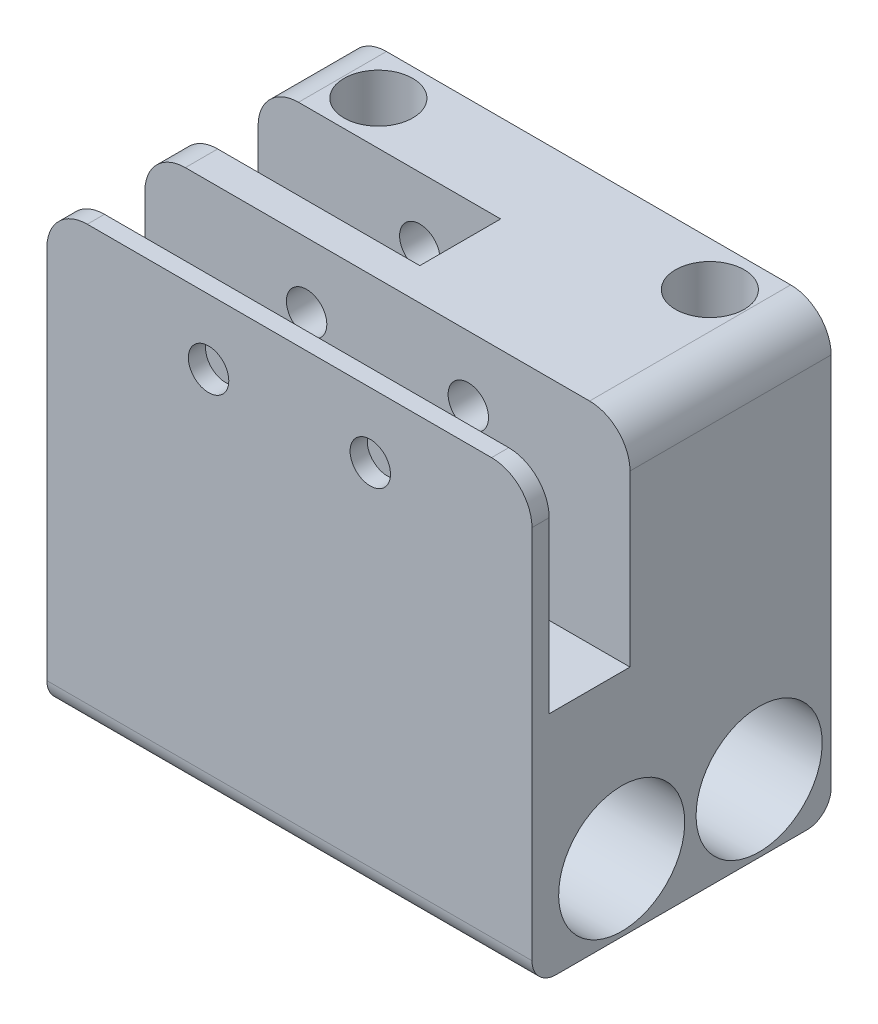
ISO-10303-21;
HEADER;
FILE_DESCRIPTION(('STEP AP214'),'2;1');
FILE_NAME('part.step','',(''),(''),'','','');
FILE_SCHEMA(('AUTOMOTIVE_DESIGN { 1 0 10303 214 1 1 1 1 }'));
ENDSEC;
DATA;
#1=APPLICATION_CONTEXT('core data for automotive mechanical design processes');
#2=APPLICATION_PROTOCOL_DEFINITION('international standard','automotive_design',2000,#1);
#3=PRODUCT_CONTEXT('',#1,'mechanical');
#4=PRODUCT('Part','Part','',(#3));
#5=PRODUCT_RELATED_PRODUCT_CATEGORY('part','',(#4));
#6=PRODUCT_DEFINITION_FORMATION('','',#4);
#7=PRODUCT_DEFINITION_CONTEXT('part definition',#1,'design');
#8=PRODUCT_DEFINITION('design','',#6,#7);
#9=PRODUCT_DEFINITION_SHAPE('','',#8);
#10=(LENGTH_UNIT() NAMED_UNIT(*) SI_UNIT(.MILLI.,.METRE.));
#11=(NAMED_UNIT(*) PLANE_ANGLE_UNIT() SI_UNIT($,.RADIAN.));
#12=(NAMED_UNIT(*) SI_UNIT($,.STERADIAN.) SOLID_ANGLE_UNIT());
#13=UNCERTAINTY_MEASURE_WITH_UNIT(LENGTH_MEASURE(1.E-05),#10,'distance_accuracy_value','');
#14=(GEOMETRIC_REPRESENTATION_CONTEXT(3) GLOBAL_UNCERTAINTY_ASSIGNED_CONTEXT((#13)) GLOBAL_UNIT_ASSIGNED_CONTEXT((#10,
#11,#12)) REPRESENTATION_CONTEXT('',''));
#15=CARTESIAN_POINT('',(0.,0.,0.));
#16=DIRECTION('',(0.,0.,1.));
#17=DIRECTION('',(1.,0.,0.));
#18=AXIS2_PLACEMENT_3D('',#15,#16,#17);
#19=CARTESIAN_POINT('',(-245.000000000002,163.212189340529,40.0000000000007));
#20=DIRECTION('',(0.,0.,-1.));
#21=DIRECTION('',(-1.,0.,0.));
#22=AXIS2_PLACEMENT_3D('',#19,#20,#21);
#23=CYLINDRICAL_SURFACE('',#22,5.);
#24=DIRECTION('',(0.,0.,-1.));
#25=VECTOR('',#24,1.);
#26=CARTESIAN_POINT('',(-250.000000000002,163.212189340529,40.0000000000007));
#27=LINE('',#26,#25);
#28=CARTESIAN_POINT('',(-250.000000000002,163.212189340529,13.8748607563633));
#29=VERTEX_POINT('',#28);
#30=CARTESIAN_POINT('',(-250.000000000002,163.212189340529,3.));
#31=VERTEX_POINT('',#30);
#32=EDGE_CURVE('E289',#29,#31,#27,.T.);
#33=ORIENTED_EDGE('',*,*,#32,.F.);
#34=CARTESIAN_POINT('',(-245.000000000002,163.212189340529,13.8748607563633));
#35=DIRECTION('',(0.,0.,-1.));
#36=DIRECTION('',(0.,1.,0.));
#37=AXIS2_PLACEMENT_3D('',#34,#35,#36);
#38=CIRCLE('',#37,5.);
#39=CARTESIAN_POINT('',(-245.000000000002,168.212189340529,13.8748607563633));
#40=VERTEX_POINT('',#39);
#41=EDGE_CURVE('E199',#29,#40,#38,.T.);
#42=ORIENTED_EDGE('',*,*,#41,.T.);
#43=DIRECTION('',(0.,0.,-1.));
#44=VECTOR('',#43,1.);
#45=CARTESIAN_POINT('',(-245.000000000002,168.212189340529,40.0000000000007));
#46=LINE('',#45,#44);
#47=CARTESIAN_POINT('',(-245.000000000002,168.212189340529,3.));
#48=VERTEX_POINT('',#47);
#49=EDGE_CURVE('E293',#40,#48,#46,.T.);
#50=ORIENTED_EDGE('',*,*,#49,.T.);
#51=CARTESIAN_POINT('',(-245.000000000002,163.212189340529,3.));
#52=DIRECTION('',(0.,0.,-1.));
#53=DIRECTION('',(-1.,0.,0.));
#54=AXIS2_PLACEMENT_3D('',#51,#52,#53);
#55=CIRCLE('',#54,5.);
#56=EDGE_CURVE('E249',#31,#48,#55,.T.);
#57=ORIENTED_EDGE('',*,*,#56,.F.);
#58=EDGE_LOOP('',(#33,#42,#50,#57));
#59=FACE_BOUND('',#58,.T.);
#60=ADVANCED_FACE('F33',(#59),#23,.T.);
#61=CARTESIAN_POINT('',(-195.000000000002,163.212189340529,40.0000000000007));
#62=DIRECTION('',(0.,0.,-1.));
#63=DIRECTION('',(-1.,0.,0.));
#64=AXIS2_PLACEMENT_3D('',#61,#62,#63);
#65=CYLINDRICAL_SURFACE('',#64,5.);
#66=DIRECTION('',(0.,0.,-1.));
#67=VECTOR('',#66,1.);
#68=CARTESIAN_POINT('',(-195.000000000002,168.212189340529,40.0000000000007));
#69=LINE('',#68,#67);
#70=CARTESIAN_POINT('',(-195.000000000002,168.212189340529,27.8748607563632));
#71=VERTEX_POINT('',#70);
#72=CARTESIAN_POINT('',(-195.000000000002,168.212189340529,3.));
#73=VERTEX_POINT('',#72);
#74=EDGE_CURVE('E298',#71,#73,#69,.T.);
#75=ORIENTED_EDGE('',*,*,#74,.F.);
#76=CARTESIAN_POINT('',(-195.000000000002,163.212189340529,27.8748607563633));
#77=DIRECTION('',(0.,0.,-1.));
#78=DIRECTION('',(0.,1.,0.));
#79=AXIS2_PLACEMENT_3D('',#76,#77,#78);
#80=CIRCLE('',#79,5.);
#81=CARTESIAN_POINT('',(-190.000000000002,163.212189340529,27.8748607563633));
#82=VERTEX_POINT('',#81);
#83=EDGE_CURVE('E237',#71,#82,#80,.T.);
#84=ORIENTED_EDGE('',*,*,#83,.T.);
#85=DIRECTION('',(0.,0.,-1.));
#86=VECTOR('',#85,1.);
#87=CARTESIAN_POINT('',(-190.000000000002,163.212189340529,40.0000000000007));
#88=LINE('',#87,#86);
#89=CARTESIAN_POINT('',(-190.000000000002,163.212189340529,3.));
#90=VERTEX_POINT('',#89);
#91=EDGE_CURVE('E279',#82,#90,#88,.T.);
#92=ORIENTED_EDGE('',*,*,#91,.T.);
#93=CARTESIAN_POINT('',(-195.000000000002,163.212189340529,3.));
#94=DIRECTION('',(0.,0.,-1.));
#95=DIRECTION('',(-1.,0.,0.));
#96=AXIS2_PLACEMENT_3D('',#93,#94,#95);
#97=CIRCLE('',#96,5.);
#98=EDGE_CURVE('E240',#73,#90,#97,.T.);
#99=ORIENTED_EDGE('',*,*,#98,.F.);
#100=EDGE_LOOP('',(#75,#84,#92,#99));
#101=FACE_BOUND('',#100,.T.);
#102=ADVANCED_FACE('F381',(#101),#65,.T.);
#103=CARTESIAN_POINT('',(-245.000000000002,168.212189340529,40.0000000000007));
#104=DIRECTION('',(0.,-1.,0.));
#105=DIRECTION('',(0.,0.,-1.));
#106=AXIS2_PLACEMENT_3D('',#103,#104,#105);
#107=PLANE('',#106);
#108=CARTESIAN_POINT('',(-199.500000000002,168.212189340529,8.5));
#109=DIRECTION('',(0.,1.,0.));
#110=DIRECTION('',(0.,0.,1.));
#111=AXIS2_PLACEMENT_3D('',#108,#109,#110);
#112=CIRCLE('',#111,4.25000000000001);
#113=CARTESIAN_POINT('',(-199.500000000002,168.212189340529,12.75));
#114=VERTEX_POINT('',#113);
#115=EDGE_CURVE('E641',#114,#114,#112,.T.);
#116=ORIENTED_EDGE('',*,*,#115,.F.);
#117=EDGE_LOOP('',(#116));
#118=FACE_BOUND('',#117,.T.);
#119=CARTESIAN_POINT('',(-240.500000000002,168.212189340529,8.50000000000003));
#120=DIRECTION('',(0.,1.,0.));
#121=DIRECTION('',(0.,0.,-1.));
#122=AXIS2_PLACEMENT_3D('',#119,#120,#121);
#123=CIRCLE('',#122,4.25);
#124=CARTESIAN_POINT('',(-240.500000000002,168.212189340529,4.25000000000003));
#125=VERTEX_POINT('',#124);
#126=EDGE_CURVE('E342',#125,#125,#123,.T.);
#127=ORIENTED_EDGE('',*,*,#126,.F.);
#128=EDGE_LOOP('',(#127));
#129=FACE_BOUND('',#128,.T.);
#130=ORIENTED_EDGE('',*,*,#49,.F.);
#131=DIRECTION('',(1.,0.,0.));
#132=VECTOR('',#131,1.);
#133=CARTESIAN_POINT('',(-245.000000000002,168.212189340529,13.8748607563633));
#134=LINE('',#133,#132);
#135=CARTESIAN_POINT('',(-220.000000000002,168.212189340529,13.8748607563643));
#136=VERTEX_POINT('',#135);
#137=EDGE_CURVE('E202',#40,#136,#134,.T.);
#138=ORIENTED_EDGE('',*,*,#137,.T.);
#139=DIRECTION('',(0.,0.,-1.));
#140=VECTOR('',#139,1.);
#141=CARTESIAN_POINT('',(-220.000000000002,168.212189340529,40.0000000000007));
#142=LINE('',#141,#140);
#143=CARTESIAN_POINT('',(-220.000000000002,168.212189340529,23.8748607563633));
#144=VERTEX_POINT('',#143);
#145=EDGE_CURVE('E11',#144,#136,#142,.T.);
#146=ORIENTED_EDGE('',*,*,#145,.F.);
#147=DIRECTION('',(-1.,0.,0.));
#148=VECTOR('',#147,1.);
#149=CARTESIAN_POINT('',(-245.000000000002,168.212189340529,23.8748607563643));
#150=LINE('',#149,#148);
#151=CARTESIAN_POINT('',(-245.000000000002,168.212189340529,23.8748607563643));
#152=VERTEX_POINT('',#151);
#153=EDGE_CURVE('E178',#144,#152,#150,.T.);
#154=ORIENTED_EDGE('',*,*,#153,.T.);
#155=CARTESIAN_POINT('',(-245.000000000002,168.212189340529,27.8748607563632));
#156=VERTEX_POINT('',#155);
#157=EDGE_CURVE('E299',#156,#152,#46,.T.);
#158=ORIENTED_EDGE('',*,*,#157,.F.);
#159=DIRECTION('',(1.,0.,0.));
#160=VECTOR('',#159,1.);
#161=CARTESIAN_POINT('',(-245.000000000002,168.212189340529,27.8748607563632));
#162=LINE('',#161,#160);
#163=EDGE_CURVE('E234',#156,#71,#162,.T.);
#164=ORIENTED_EDGE('',*,*,#163,.T.);
#165=ORIENTED_EDGE('',*,*,#74,.T.);
#166=DIRECTION('',(1.,0.,0.));
#167=VECTOR('',#166,1.);
#168=CARTESIAN_POINT('',(-245.000000000002,168.212189340529,3.));
#169=LINE('',#168,#167);
#170=EDGE_CURVE('E252',#48,#73,#169,.T.);
#171=ORIENTED_EDGE('',*,*,#170,.F.);
#172=EDGE_LOOP('',(#130,#138,#146,#154,#158,#164,#165,#171));
#173=FACE_BOUND('',#172,.T.);
#174=ADVANCED_FACE('F389',(#118,#129,#173),#107,.F.);
#175=ORIENTED_EDGE('',*,*,#157,.T.);
#176=CARTESIAN_POINT('',(-245.000000000002,163.212189340529,23.874860756364));
#177=DIRECTION('',(0.,0.,1.));
#178=DIRECTION('',(0.,-1.,0.));
#179=AXIS2_PLACEMENT_3D('',#176,#177,#178);
#180=CIRCLE('',#179,5.);
#181=CARTESIAN_POINT('',(-250.000000000002,163.212189340529,23.874860756364));
#182=VERTEX_POINT('',#181);
#183=EDGE_CURVE('E194',#152,#182,#180,.T.);
#184=ORIENTED_EDGE('',*,*,#183,.T.);
#185=CARTESIAN_POINT('',(-250.000000000002,163.212189340529,27.8748607563633));
#186=VERTEX_POINT('',#185);
#187=EDGE_CURVE('E294',#186,#182,#27,.T.);
#188=ORIENTED_EDGE('',*,*,#187,.F.);
#189=CARTESIAN_POINT('',(-245.000000000002,163.212189340529,27.8748607563633));
#190=DIRECTION('',(0.,0.,-1.));
#191=DIRECTION('',(0.,1.,0.));
#192=AXIS2_PLACEMENT_3D('',#189,#190,#191);
#193=CIRCLE('',#192,5.);
#194=EDGE_CURVE('E231',#186,#156,#193,.T.);
#195=ORIENTED_EDGE('',*,*,#194,.T.);
#196=EDGE_LOOP('',(#175,#184,#188,#195));
#197=FACE_BOUND('',#196,.T.);
#198=ADVANCED_FACE('F384',(#197),#23,.T.);
#199=CARTESIAN_POINT('',(-190.000000000002,163.212189340529,40.0000000000007));
#200=VERTEX_POINT('',#199);
#201=CARTESIAN_POINT('',(-190.000000000002,163.212189340529,37.8748607563633));
#202=VERTEX_POINT('',#201);
#203=EDGE_CURVE('E280',#200,#202,#88,.T.);
#204=ORIENTED_EDGE('',*,*,#203,.T.);
#205=CARTESIAN_POINT('',(-195.000000000002,163.212189340529,37.8748607563633));
#206=DIRECTION('',(0.,0.,1.));
#207=DIRECTION('',(0.,-1.,0.));
#208=AXIS2_PLACEMENT_3D('',#205,#206,#207);
#209=CIRCLE('',#208,5.);
#210=CARTESIAN_POINT('',(-195.000000000002,168.212189340529,37.8748607563633));
#211=VERTEX_POINT('',#210);
#212=EDGE_CURVE('E58',#202,#211,#209,.T.);
#213=ORIENTED_EDGE('',*,*,#212,.T.);
#214=CARTESIAN_POINT('',(-195.000000000002,168.212189340529,40.0000000000007));
#215=VERTEX_POINT('',#214);
#216=EDGE_CURVE('E300',#215,#211,#69,.T.);
#217=ORIENTED_EDGE('',*,*,#216,.F.);
#218=CARTESIAN_POINT('',(-195.000000000002,163.212189340529,40.0000000000007));
#219=DIRECTION('',(0.,0.,1.));
#220=DIRECTION('',(-1.,0.,0.));
#221=AXIS2_PLACEMENT_3D('',#218,#219,#220);
#222=CIRCLE('',#221,5.);
#223=EDGE_CURVE('E259',#200,#215,#222,.T.);
#224=ORIENTED_EDGE('',*,*,#223,.F.);
#225=EDGE_LOOP('',(#204,#213,#217,#224));
#226=FACE_BOUND('',#225,.T.);
#227=ADVANCED_FACE('F392',(#226),#65,.T.);
#228=ORIENTED_EDGE('',*,*,#216,.T.);
#229=DIRECTION('',(-1.,0.,0.));
#230=VECTOR('',#229,1.);
#231=CARTESIAN_POINT('',(-245.000000000002,168.212189340529,37.8748607563633));
#232=LINE('',#231,#230);
#233=CARTESIAN_POINT('',(-245.000000000002,168.212189340529,37.8748607563633));
#234=VERTEX_POINT('',#233);
#235=EDGE_CURVE('E227',#211,#234,#232,.T.);
#236=ORIENTED_EDGE('',*,*,#235,.T.);
#237=CARTESIAN_POINT('',(-245.000000000002,168.212189340529,40.0000000000007));
#238=VERTEX_POINT('',#237);
#239=EDGE_CURVE('E295',#238,#234,#46,.T.);
#240=ORIENTED_EDGE('',*,*,#239,.F.);
#241=DIRECTION('',(-1.,0.,0.));
#242=VECTOR('',#241,1.);
#243=CARTESIAN_POINT('',(-245.000000000002,168.212189340529,40.0000000000007));
#244=LINE('',#243,#242);
#245=EDGE_CURVE('E270',#215,#238,#244,.T.);
#246=ORIENTED_EDGE('',*,*,#245,.F.);
#247=EDGE_LOOP('',(#228,#236,#240,#246));
#248=FACE_BOUND('',#247,.T.);
#249=ADVANCED_FACE('F400',(#248),#107,.F.);
#250=ORIENTED_EDGE('',*,*,#239,.T.);
#251=CARTESIAN_POINT('',(-245.000000000002,163.212189340529,37.8748607563633));
#252=DIRECTION('',(0.,0.,1.));
#253=DIRECTION('',(0.,-1.,0.));
#254=AXIS2_PLACEMENT_3D('',#251,#252,#253);
#255=CIRCLE('',#254,5.);
#256=CARTESIAN_POINT('',(-250.000000000002,163.212189340529,37.8748607563633));
#257=VERTEX_POINT('',#256);
#258=EDGE_CURVE('E222',#234,#257,#255,.T.);
#259=ORIENTED_EDGE('',*,*,#258,.T.);
#260=CARTESIAN_POINT('',(-250.000000000002,163.212189340529,40.0000000000007));
#261=VERTEX_POINT('',#260);
#262=EDGE_CURVE('E290',#261,#257,#27,.T.);
#263=ORIENTED_EDGE('',*,*,#262,.F.);
#264=CARTESIAN_POINT('',(-245.000000000002,163.212189340529,40.0000000000007));
#265=DIRECTION('',(0.,0.,1.));
#266=DIRECTION('',(-1.,0.,0.));
#267=AXIS2_PLACEMENT_3D('',#264,#265,#266);
#268=CIRCLE('',#267,5.);
#269=EDGE_CURVE('E272',#238,#261,#268,.T.);
#270=ORIENTED_EDGE('',*,*,#269,.F.);
#271=EDGE_LOOP('',(#250,#259,#263,#270));
#272=FACE_BOUND('',#271,.T.);
#273=ADVANCED_FACE('F385',(#272),#23,.T.);
#274=CARTESIAN_POINT('',(-250.000000000002,138.123568891244,40.0000000000007));
#275=DIRECTION('',(1.,0.,0.));
#276=DIRECTION('',(0.,0.,-1.));
#277=AXIS2_PLACEMENT_3D('',#274,#275,#276);
#278=PLANE('',#277);
#279=CARTESIAN_POINT('',(-250.000000000002,122.212171492543,28.9024120802243));
#280=DIRECTION('',(1.,0.,0.));
#281=DIRECTION('',(0.,1.,0.));
#282=AXIS2_PLACEMENT_3D('',#279,#280,#281);
#283=CIRCLE('',#282,7.80000000000167);
#284=CARTESIAN_POINT('',(-250.000000000002,130.012171492544,28.9024120802243));
#285=VERTEX_POINT('',#284);
#286=EDGE_CURVE('E263',#285,#285,#283,.T.);
#287=ORIENTED_EDGE('',*,*,#286,.T.);
#288=EDGE_LOOP('',(#287));
#289=FACE_BOUND('',#288,.T.);
#290=CARTESIAN_POINT('',(-250.000000000002,122.212171492543,11.9024120802243));
#291=DIRECTION('',(1.,0.,0.));
#292=DIRECTION('',(0.,1.,0.));
#293=AXIS2_PLACEMENT_3D('',#290,#291,#292);
#294=CIRCLE('',#293,7.8000000000017);
#295=CARTESIAN_POINT('',(-250.000000000002,130.012171492544,11.9024120802243));
#296=VERTEX_POINT('',#295);
#297=EDGE_CURVE('E256',#296,#296,#294,.T.);
#298=ORIENTED_EDGE('',*,*,#297,.T.);
#299=EDGE_LOOP('',(#298));
#300=FACE_BOUND('',#299,.T.);
#301=DIRECTION('',(0.,0.,1.));
#302=VECTOR('',#301,1.);
#303=CARTESIAN_POINT('',(-250.000000000002,142.212171492543,13.8748607563632));
#304=LINE('',#303,#302);
#305=CARTESIAN_POINT('',(-250.000000000002,142.212171492543,13.8748607563632));
#306=VERTEX_POINT('',#305);
#307=CARTESIAN_POINT('',(-250.000000000002,142.212171492543,23.8748607563626));
#308=VERTEX_POINT('',#307);
#309=EDGE_CURVE('E50',#306,#308,#304,.T.);
#310=ORIENTED_EDGE('',*,*,#309,.F.);
#311=DIRECTION('',(0.,1.,0.));
#312=VECTOR('',#311,1.);
#313=CARTESIAN_POINT('',(-250.000000000002,138.123568891244,13.8748607563632));
#314=LINE('',#313,#312);
#315=EDGE_CURVE('E42',#306,#29,#314,.T.);
#316=ORIENTED_EDGE('',*,*,#315,.T.);
#317=ORIENTED_EDGE('',*,*,#32,.T.);
#318=DIRECTION('',(0.,1.,0.));
#319=VECTOR('',#318,1.);
#320=CARTESIAN_POINT('',(-250.000000000002,113.822486612554,3.));
#321=LINE('',#320,#319);
#322=CARTESIAN_POINT('',(-250.000000000002,116.822486612554,3.));
#323=VERTEX_POINT('',#322);
#324=EDGE_CURVE('E246',#323,#31,#321,.T.);
#325=ORIENTED_EDGE('',*,*,#324,.F.);
#326=CARTESIAN_POINT('',(-250.000000000002,116.822486612554,6.));
#327=DIRECTION('',(1.,0.,0.));
#328=DIRECTION('',(0.,0.,-1.));
#329=AXIS2_PLACEMENT_3D('',#326,#327,#328);
#330=CIRCLE('',#329,3.);
#331=CARTESIAN_POINT('',(-250.000000000002,113.822486612554,6.));
#332=VERTEX_POINT('',#331);
#333=EDGE_CURVE('E308',#323,#332,#330,.F.);
#334=ORIENTED_EDGE('',*,*,#333,.T.);
#335=DIRECTION('',(0.,0.,-1.));
#336=VECTOR('',#335,1.);
#337=CARTESIAN_POINT('',(-250.000000000002,113.822486612554,40.0000000000007));
#338=LINE('',#337,#336);
#339=CARTESIAN_POINT('',(-250.000000000002,113.822486612554,37.0000000000007));
#340=VERTEX_POINT('',#339);
#341=EDGE_CURVE('E286',#340,#332,#338,.T.);
#342=ORIENTED_EDGE('',*,*,#341,.F.);
#343=CARTESIAN_POINT('',(-250.000000000002,116.822486612554,37.0000000000007));
#344=DIRECTION('',(1.,0.,0.));
#345=DIRECTION('',(0.,0.,-1.));
#346=AXIS2_PLACEMENT_3D('',#343,#344,#345);
#347=CIRCLE('',#346,3.);
#348=CARTESIAN_POINT('',(-250.000000000002,116.822486612554,40.0000000000007));
#349=VERTEX_POINT('',#348);
#350=EDGE_CURVE('E306',#340,#349,#347,.F.);
#351=ORIENTED_EDGE('',*,*,#350,.T.);
#352=DIRECTION('',(0.,-1.,0.));
#353=VECTOR('',#352,1.);
#354=CARTESIAN_POINT('',(-250.000000000002,138.123568891244,40.0000000000007));
#355=LINE('',#354,#353);
#356=EDGE_CURVE('E274',#261,#349,#355,.T.);
#357=ORIENTED_EDGE('',*,*,#356,.F.);
#358=ORIENTED_EDGE('',*,*,#262,.T.);
#359=DIRECTION('',(0.,-1.,0.));
#360=VECTOR('',#359,1.);
#361=CARTESIAN_POINT('',(-250.000000000002,152.212171492543,37.8748607563633));
#362=LINE('',#361,#360);
#363=CARTESIAN_POINT('',(-250.000000000002,142.212171492543,37.8748607563632));
#364=VERTEX_POINT('',#363);
#365=EDGE_CURVE('E206',#257,#364,#362,.T.);
#366=ORIENTED_EDGE('',*,*,#365,.T.);
#367=DIRECTION('',(0.,0.,-1.));
#368=VECTOR('',#367,1.);
#369=CARTESIAN_POINT('',(-250.000000000002,142.212171492543,27.8748607563632));
#370=LINE('',#369,#368);
#371=CARTESIAN_POINT('',(-250.000000000002,142.212171492543,27.8748607563632));
#372=VERTEX_POINT('',#371);
#373=EDGE_CURVE('E209',#364,#372,#370,.T.);
#374=ORIENTED_EDGE('',*,*,#373,.T.);
#375=DIRECTION('',(0.,1.,0.));
#376=VECTOR('',#375,1.);
#377=CARTESIAN_POINT('',(-250.000000000002,142.212171492543,27.8748607563632));
#378=LINE('',#377,#376);
#379=EDGE_CURVE('E213',#372,#186,#378,.T.);
#380=ORIENTED_EDGE('',*,*,#379,.T.);
#381=ORIENTED_EDGE('',*,*,#187,.T.);
#382=DIRECTION('',(0.,1.,0.));
#383=VECTOR('',#382,1.);
#384=CARTESIAN_POINT('',(-250.000000000002,152.212171492543,23.8748607563633));
#385=LINE('',#384,#383);
#386=EDGE_CURVE('E185',#308,#182,#385,.T.);
#387=ORIENTED_EDGE('',*,*,#386,.F.);
#388=EDGE_LOOP('',(#310,#316,#317,#325,#334,#342,#351,#357,#358,#366,#374,#380,#381,#387));
#389=FACE_BOUND('',#388,.T.);
#390=ADVANCED_FACE('F399',(#289,#300,#389),#278,.F.);
#391=CARTESIAN_POINT('',(-194.03319899616,113.822486612554,40.0000000000007));
#392=DIRECTION('',(0.,1.,0.));
#393=DIRECTION('',(0.,0.,1.));
#394=AXIS2_PLACEMENT_3D('',#391,#392,#393);
#395=PLANE('',#394);
#396=ORIENTED_EDGE('',*,*,#341,.T.);
#397=DIRECTION('',(-1.,0.,0.));
#398=VECTOR('',#397,1.);
#399=CARTESIAN_POINT('',(-190.000000000002,113.822486612554,6.));
#400=LINE('',#399,#398);
#401=CARTESIAN_POINT('',(-190.000000000002,113.822486612554,6.));
#402=VERTEX_POINT('',#401);
#403=EDGE_CURVE('E312',#332,#402,#400,.F.);
#404=ORIENTED_EDGE('',*,*,#403,.T.);
#405=DIRECTION('',(0.,0.,-1.));
#406=VECTOR('',#405,1.);
#407=CARTESIAN_POINT('',(-190.000000000002,113.822486612554,40.0000000000007));
#408=LINE('',#407,#406);
#409=CARTESIAN_POINT('',(-190.000000000002,113.822486612554,37.0000000000007));
#410=VERTEX_POINT('',#409);
#411=EDGE_CURVE('E283',#410,#402,#408,.T.);
#412=ORIENTED_EDGE('',*,*,#411,.F.);
#413=DIRECTION('',(1.,0.,0.));
#414=VECTOR('',#413,1.);
#415=CARTESIAN_POINT('',(-194.03319899616,113.822486612554,37.0000000000007));
#416=LINE('',#415,#414);
#417=EDGE_CURVE('E310',#410,#340,#416,.F.);
#418=ORIENTED_EDGE('',*,*,#417,.T.);
#419=EDGE_LOOP('',(#396,#404,#412,#418));
#420=FACE_BOUND('',#419,.T.);
#421=ADVANCED_FACE('F406',(#420),#395,.F.);
#422=CARTESIAN_POINT('',(-190.000000000002,163.212189340529,40.0000000000007));
#423=DIRECTION('',(-1.,0.,0.));
#424=DIRECTION('',(0.,-1.,0.));
#425=AXIS2_PLACEMENT_3D('',#422,#423,#424);
#426=PLANE('',#425);
#427=CARTESIAN_POINT('',(-190.000000000002,122.212171492543,28.9024120802243));
#428=DIRECTION('',(1.,0.,0.));
#429=DIRECTION('',(0.,1.,0.));
#430=AXIS2_PLACEMENT_3D('',#427,#428,#429);
#431=CIRCLE('',#430,7.80000000000167);
#432=CARTESIAN_POINT('',(-190.000000000002,130.012171492544,28.9024120802243));
#433=VERTEX_POINT('',#432);
#434=EDGE_CURVE('E255',#433,#433,#431,.T.);
#435=ORIENTED_EDGE('',*,*,#434,.F.);
#436=EDGE_LOOP('',(#435));
#437=FACE_BOUND('',#436,.T.);
#438=CARTESIAN_POINT('',(-190.000000000002,122.212171492543,11.9024120802243));
#439=DIRECTION('',(1.,0.,0.));
#440=DIRECTION('',(0.,1.,0.));
#441=AXIS2_PLACEMENT_3D('',#438,#439,#440);
#442=CIRCLE('',#441,7.8000000000017);
#443=CARTESIAN_POINT('',(-190.000000000002,130.012171492545,11.9024120802243));
#444=VERTEX_POINT('',#443);
#445=EDGE_CURVE('E260',#444,#444,#442,.T.);
#446=ORIENTED_EDGE('',*,*,#445,.F.);
#447=EDGE_LOOP('',(#446));
#448=FACE_BOUND('',#447,.T.);
#449=ORIENTED_EDGE('',*,*,#91,.F.);
#450=DIRECTION('',(0.,1.,0.));
#451=VECTOR('',#450,1.);
#452=CARTESIAN_POINT('',(-190.000000000002,152.212171492543,27.8748607563633));
#453=LINE('',#452,#451);
#454=CARTESIAN_POINT('',(-190.000000000002,142.212171492543,27.8748607563632));
#455=VERTEX_POINT('',#454);
#456=EDGE_CURVE('E210',#455,#82,#453,.T.);
#457=ORIENTED_EDGE('',*,*,#456,.F.);
#458=DIRECTION('',(0.,0.,-1.));
#459=VECTOR('',#458,1.);
#460=CARTESIAN_POINT('',(-190.000000000002,142.212171492543,27.8748607563632));
#461=LINE('',#460,#459);
#462=CARTESIAN_POINT('',(-190.000000000002,142.212171492543,37.8748607563632));
#463=VERTEX_POINT('',#462);
#464=EDGE_CURVE('E205',#463,#455,#461,.T.);
#465=ORIENTED_EDGE('',*,*,#464,.F.);
#466=DIRECTION('',(0.,1.,0.));
#467=VECTOR('',#466,1.);
#468=CARTESIAN_POINT('',(-190.000000000002,163.212189340529,37.8748607563633));
#469=LINE('',#468,#467);
#470=EDGE_CURVE('E321',#463,#202,#469,.T.);
#471=ORIENTED_EDGE('',*,*,#470,.T.);
#472=ORIENTED_EDGE('',*,*,#203,.F.);
#473=DIRECTION('',(0.,1.,0.));
#474=VECTOR('',#473,1.);
#475=CARTESIAN_POINT('',(-190.000000000002,113.822486612554,40.0000000000007));
#476=LINE('',#475,#474);
#477=CARTESIAN_POINT('',(-190.000000000002,116.822486612554,40.0000000000007));
#478=VERTEX_POINT('',#477);
#479=EDGE_CURVE('E277',#478,#200,#476,.T.);
#480=ORIENTED_EDGE('',*,*,#479,.F.);
#481=CARTESIAN_POINT('',(-190.000000000002,116.822486612554,37.0000000000007));
#482=DIRECTION('',(-1.,0.,0.));
#483=DIRECTION('',(0.,-1.,0.));
#484=AXIS2_PLACEMENT_3D('',#481,#482,#483);
#485=CIRCLE('',#484,3.);
#486=EDGE_CURVE('E314',#478,#410,#485,.F.);
#487=ORIENTED_EDGE('',*,*,#486,.T.);
#488=ORIENTED_EDGE('',*,*,#411,.T.);
#489=CARTESIAN_POINT('',(-190.000000000002,116.822486612554,6.));
#490=DIRECTION('',(-1.,0.,0.));
#491=DIRECTION('',(0.,-1.,0.));
#492=AXIS2_PLACEMENT_3D('',#489,#490,#491);
#493=CIRCLE('',#492,3.);
#494=CARTESIAN_POINT('',(-190.000000000002,116.822486612554,3.));
#495=VERTEX_POINT('',#494);
#496=EDGE_CURVE('E316',#402,#495,#493,.F.);
#497=ORIENTED_EDGE('',*,*,#496,.T.);
#498=DIRECTION('',(0.,-1.,0.));
#499=VECTOR('',#498,1.);
#500=CARTESIAN_POINT('',(-190.000000000002,163.212189340529,3.));
#501=LINE('',#500,#499);
#502=EDGE_CURVE('E243',#90,#495,#501,.T.);
#503=ORIENTED_EDGE('',*,*,#502,.F.);
#504=EDGE_LOOP('',(#449,#457,#465,#471,#472,#480,#487,#488,#497,#503));
#505=FACE_BOUND('',#504,.T.);
#506=ADVANCED_FACE('F420',(#437,#448,#505),#426,.F.);
#507=CARTESIAN_POINT('',(-195.000000000002,163.212189340529,40.0000000000007));
#508=DIRECTION('',(0.,0.,-1.));
#509=DIRECTION('',(-1.,0.,0.));
#510=AXIS2_PLACEMENT_3D('',#507,#508,#509);
#511=PLANE('',#510);
#512=CARTESIAN_POINT('',(-210.000000000002,160.17310793431,40.0000000000007));
#513=DIRECTION('',(0.,0.,1.));
#514=DIRECTION('',(1.,0.,0.));
#515=AXIS2_PLACEMENT_3D('',#512,#513,#514);
#516=CIRCLE('',#515,2.5);
#517=CARTESIAN_POINT('',(-207.500000000002,160.17310793431,40.0000000000007));
#518=VERTEX_POINT('',#517);
#519=EDGE_CURVE('E334',#518,#518,#516,.T.);
#520=ORIENTED_EDGE('',*,*,#519,.F.);
#521=EDGE_LOOP('',(#520));
#522=FACE_BOUND('',#521,.T.);
#523=CARTESIAN_POINT('',(-230.000000000002,160.17310793431,40.0000000000007));
#524=DIRECTION('',(0.,0.,1.));
#525=DIRECTION('',(1.,0.,0.));
#526=AXIS2_PLACEMENT_3D('',#523,#524,#525);
#527=CIRCLE('',#526,2.5);
#528=CARTESIAN_POINT('',(-227.500000000002,160.17310793431,40.0000000000007));
#529=VERTEX_POINT('',#528);
#530=EDGE_CURVE('E347',#529,#529,#527,.T.);
#531=ORIENTED_EDGE('',*,*,#530,.F.);
#532=EDGE_LOOP('',(#531));
#533=FACE_BOUND('',#532,.T.);
#534=ORIENTED_EDGE('',*,*,#356,.T.);
#535=DIRECTION('',(1.,0.,0.));
#536=VECTOR('',#535,1.);
#537=CARTESIAN_POINT('',(-195.000000000002,116.822486612554,40.0000000000007));
#538=LINE('',#537,#536);
#539=EDGE_CURVE('E318',#349,#478,#538,.T.);
#540=ORIENTED_EDGE('',*,*,#539,.T.);
#541=ORIENTED_EDGE('',*,*,#479,.T.);
#542=ORIENTED_EDGE('',*,*,#223,.T.);
#543=ORIENTED_EDGE('',*,*,#245,.T.);
#544=ORIENTED_EDGE('',*,*,#269,.T.);
#545=EDGE_LOOP('',(#534,#540,#541,#542,#543,#544));
#546=FACE_BOUND('',#545,.T.);
#547=ADVANCED_FACE('F433',(#522,#533,#546),#511,.F.);
#548=CARTESIAN_POINT('',(-250.000000000002,122.212171492543,28.9024120802243));
#549=DIRECTION('',(1.,0.,0.));
#550=DIRECTION('',(0.,1.,0.));
#551=AXIS2_PLACEMENT_3D('',#548,#549,#550);
#552=CYLINDRICAL_SURFACE('',#551,7.80000000000167);
#553=ORIENTED_EDGE('',*,*,#286,.F.);
#554=EDGE_LOOP('',(#553));
#555=FACE_BOUND('',#554,.T.);
#556=ORIENTED_EDGE('',*,*,#434,.T.);
#557=EDGE_LOOP('',(#556));
#558=FACE_BOUND('',#557,.T.);
#559=ADVANCED_FACE('F484',(#555,#558),#552,.F.);
#560=CARTESIAN_POINT('',(-250.000000000002,122.212171492543,11.9024120802243));
#561=DIRECTION('',(1.,0.,0.));
#562=DIRECTION('',(0.,1.,0.));
#563=AXIS2_PLACEMENT_3D('',#560,#561,#562);
#564=CYLINDRICAL_SURFACE('',#563,7.8000000000017);
#565=ORIENTED_EDGE('',*,*,#297,.F.);
#566=EDGE_LOOP('',(#565));
#567=FACE_BOUND('',#566,.T.);
#568=ORIENTED_EDGE('',*,*,#445,.T.);
#569=EDGE_LOOP('',(#568));
#570=FACE_BOUND('',#569,.T.);
#571=ADVANCED_FACE('F481',(#567,#570),#564,.F.);
#572=CARTESIAN_POINT('',(-195.000000000002,163.212189340529,3.));
#573=DIRECTION('',(0.,0.,-1.));
#574=DIRECTION('',(-1.,0.,0.));
#575=AXIS2_PLACEMENT_3D('',#572,#573,#574);
#576=PLANE('',#575);
#577=CARTESIAN_POINT('',(-210.000000000002,160.17310793431,3.));
#578=DIRECTION('',(0.,0.,1.));
#579=DIRECTION('',(1.,0.,0.));
#580=AXIS2_PLACEMENT_3D('',#577,#578,#579);
#581=CIRCLE('',#580,2.5);
#582=CARTESIAN_POINT('',(-207.500000000002,160.17310793431,3.));
#583=VERTEX_POINT('',#582);
#584=EDGE_CURVE('E327',#583,#583,#581,.T.);
#585=ORIENTED_EDGE('',*,*,#584,.T.);
#586=EDGE_LOOP('',(#585));
#587=FACE_BOUND('',#586,.T.);
#588=CARTESIAN_POINT('',(-230.000000000002,160.17310793431,3.));
#589=DIRECTION('',(0.,0.,1.));
#590=DIRECTION('',(1.,0.,0.));
#591=AXIS2_PLACEMENT_3D('',#588,#589,#590);
#592=CIRCLE('',#591,2.5);
#593=CARTESIAN_POINT('',(-227.500000000002,160.17310793431,3.));
#594=VERTEX_POINT('',#593);
#595=EDGE_CURVE('E339',#594,#594,#592,.T.);
#596=ORIENTED_EDGE('',*,*,#595,.T.);
#597=EDGE_LOOP('',(#596));
#598=FACE_BOUND('',#597,.T.);
#599=ORIENTED_EDGE('',*,*,#502,.T.);
#600=DIRECTION('',(-1.,0.,0.));
#601=VECTOR('',#600,1.);
#602=CARTESIAN_POINT('',(-250.000000000002,116.822486612554,3.));
#603=LINE('',#602,#601);
#604=EDGE_CURVE('E303',#495,#323,#603,.T.);
#605=ORIENTED_EDGE('',*,*,#604,.T.);
#606=ORIENTED_EDGE('',*,*,#324,.T.);
#607=ORIENTED_EDGE('',*,*,#56,.T.);
#608=ORIENTED_EDGE('',*,*,#170,.T.);
#609=ORIENTED_EDGE('',*,*,#98,.T.);
#610=EDGE_LOOP('',(#599,#605,#606,#607,#608,#609));
#611=FACE_BOUND('',#610,.T.);
#612=ADVANCED_FACE('F445',(#587,#598,#611),#576,.T.);
#613=CARTESIAN_POINT('',(-195.000000000002,116.822486612554,6.));
#614=DIRECTION('',(1.,0.,0.));
#615=DIRECTION('',(0.,0.,-1.));
#616=AXIS2_PLACEMENT_3D('',#613,#614,#615);
#617=CYLINDRICAL_SURFACE('',#616,3.);
#618=ORIENTED_EDGE('',*,*,#496,.F.);
#619=ORIENTED_EDGE('',*,*,#403,.F.);
#620=ORIENTED_EDGE('',*,*,#333,.F.);
#621=ORIENTED_EDGE('',*,*,#604,.F.);
#622=EDGE_LOOP('',(#618,#619,#620,#621));
#623=FACE_BOUND('',#622,.T.);
#624=ADVANCED_FACE('F441',(#623),#617,.T.);
#625=CARTESIAN_POINT('',(-195.000000000002,116.822486612554,37.0000000000007));
#626=DIRECTION('',(1.,0.,0.));
#627=DIRECTION('',(0.,0.,-1.));
#628=AXIS2_PLACEMENT_3D('',#625,#626,#627);
#629=CYLINDRICAL_SURFACE('',#628,3.);
#630=ORIENTED_EDGE('',*,*,#350,.F.);
#631=ORIENTED_EDGE('',*,*,#417,.F.);
#632=ORIENTED_EDGE('',*,*,#486,.F.);
#633=ORIENTED_EDGE('',*,*,#539,.F.);
#634=EDGE_LOOP('',(#630,#631,#632,#633));
#635=FACE_BOUND('',#634,.T.);
#636=ADVANCED_FACE('F35',(#635),#629,.T.);
#637=CARTESIAN_POINT('',(-250.000000000002,152.212171492543,27.8748607563633));
#638=DIRECTION('',(0.,0.,-1.));
#639=DIRECTION('',(0.,1.,0.));
#640=AXIS2_PLACEMENT_3D('',#637,#638,#639);
#641=PLANE('',#640);
#642=CARTESIAN_POINT('',(-210.000000000002,160.17310793431,27.8748607563633));
#643=DIRECTION('',(0.,0.,-1.));
#644=DIRECTION('',(0.,1.,0.));
#645=AXIS2_PLACEMENT_3D('',#642,#643,#644);
#646=CIRCLE('',#645,2.5);
#647=CARTESIAN_POINT('',(-210.000000000002,162.67310793431,27.8748607563633));
#648=VERTEX_POINT('',#647);
#649=EDGE_CURVE('E189',#648,#648,#646,.T.);
#650=ORIENTED_EDGE('',*,*,#649,.T.);
#651=EDGE_LOOP('',(#650));
#652=FACE_BOUND('',#651,.T.);
#653=CARTESIAN_POINT('',(-230.000000000002,160.17310793431,27.8748607563633));
#654=DIRECTION('',(0.,0.,-1.));
#655=DIRECTION('',(0.,1.,0.));
#656=AXIS2_PLACEMENT_3D('',#653,#654,#655);
#657=CIRCLE('',#656,2.5);
#658=CARTESIAN_POINT('',(-230.000000000002,162.67310793431,27.8748607563633));
#659=VERTEX_POINT('',#658);
#660=EDGE_CURVE('E352',#659,#659,#657,.T.);
#661=ORIENTED_EDGE('',*,*,#660,.T.);
#662=EDGE_LOOP('',(#661));
#663=FACE_BOUND('',#662,.T.);
#664=ORIENTED_EDGE('',*,*,#163,.F.);
#665=ORIENTED_EDGE('',*,*,#194,.F.);
#666=ORIENTED_EDGE('',*,*,#379,.F.);
#667=DIRECTION('',(1.,0.,0.));
#668=VECTOR('',#667,1.);
#669=CARTESIAN_POINT('',(-250.000000000002,142.212171492543,27.8748607563632));
#670=LINE('',#669,#668);
#671=EDGE_CURVE('E220',#372,#455,#670,.T.);
#672=ORIENTED_EDGE('',*,*,#671,.T.);
#673=ORIENTED_EDGE('',*,*,#456,.T.);
#674=ORIENTED_EDGE('',*,*,#83,.F.);
#675=EDGE_LOOP('',(#664,#665,#666,#672,#673,#674));
#676=FACE_BOUND('',#675,.T.);
#677=ADVANCED_FACE('F362',(#652,#663,#676),#641,.F.);
#678=CARTESIAN_POINT('',(-250.000000000002,142.212171492543,37.8748607563632));
#679=DIRECTION('',(0.,0.,1.));
#680=DIRECTION('',(0.,-1.,0.));
#681=AXIS2_PLACEMENT_3D('',#678,#679,#680);
#682=PLANE('',#681);
#683=CARTESIAN_POINT('',(-210.000000000002,160.17310793431,37.8748607563633));
#684=DIRECTION('',(0.,0.,1.));
#685=DIRECTION('',(0.,-1.,0.));
#686=AXIS2_PLACEMENT_3D('',#683,#684,#685);
#687=CIRCLE('',#686,2.5);
#688=CARTESIAN_POINT('',(-210.000000000002,157.673107934309,37.8748607563633));
#689=VERTEX_POINT('',#688);
#690=EDGE_CURVE('E37',#689,#689,#687,.T.);
#691=ORIENTED_EDGE('',*,*,#690,.T.);
#692=EDGE_LOOP('',(#691));
#693=FACE_BOUND('',#692,.T.);
#694=CARTESIAN_POINT('',(-230.000000000002,160.17310793431,37.8748607563633));
#695=DIRECTION('',(0.,0.,1.));
#696=DIRECTION('',(0.,-1.,0.));
#697=AXIS2_PLACEMENT_3D('',#694,#695,#696);
#698=CIRCLE('',#697,2.5);
#699=CARTESIAN_POINT('',(-230.000000000002,157.673107934309,37.8748607563633));
#700=VERTEX_POINT('',#699);
#701=EDGE_CURVE('E331',#700,#700,#698,.T.);
#702=ORIENTED_EDGE('',*,*,#701,.T.);
#703=EDGE_LOOP('',(#702));
#704=FACE_BOUND('',#703,.T.);
#705=ORIENTED_EDGE('',*,*,#470,.F.);
#706=DIRECTION('',(1.,0.,0.));
#707=VECTOR('',#706,1.);
#708=CARTESIAN_POINT('',(-250.000000000002,142.212171492543,37.8748607563632));
#709=LINE('',#708,#707);
#710=EDGE_CURVE('E216',#364,#463,#709,.T.);
#711=ORIENTED_EDGE('',*,*,#710,.F.);
#712=ORIENTED_EDGE('',*,*,#365,.F.);
#713=ORIENTED_EDGE('',*,*,#258,.F.);
#714=ORIENTED_EDGE('',*,*,#235,.F.);
#715=ORIENTED_EDGE('',*,*,#212,.F.);
#716=EDGE_LOOP('',(#705,#711,#712,#713,#714,#715));
#717=FACE_BOUND('',#716,.T.);
#718=ADVANCED_FACE('F413',(#693,#704,#717),#682,.F.);
#719=CARTESIAN_POINT('',(-250.000000000002,142.212171492543,27.8748607563632));
#720=DIRECTION('',(0.,-1.,0.));
#721=DIRECTION('',(1.,0.,0.));
#722=AXIS2_PLACEMENT_3D('',#719,#720,#721);
#723=PLANE('',#722);
#724=ORIENTED_EDGE('',*,*,#464,.T.);
#725=ORIENTED_EDGE('',*,*,#671,.F.);
#726=ORIENTED_EDGE('',*,*,#373,.F.);
#727=ORIENTED_EDGE('',*,*,#710,.T.);
#728=EDGE_LOOP('',(#724,#725,#726,#727));
#729=FACE_BOUND('',#728,.T.);
#730=ADVANCED_FACE('F425',(#729),#723,.F.);
#731=CARTESIAN_POINT('',(-220.000000000002,0.,0.));
#732=DIRECTION('',(-1.,0.,0.));
#733=DIRECTION('',(0.,0.,1.));
#734=AXIS2_PLACEMENT_3D('',#731,#732,#733);
#735=PLANE('',#734);
#736=ORIENTED_EDGE('',*,*,#145,.T.);
#737=DIRECTION('',(0.,-1.,0.));
#738=VECTOR('',#737,1.);
#739=CARTESIAN_POINT('',(-220.000000000002,182.191519564867,13.8748607563652));
#740=LINE('',#739,#738);
#741=CARTESIAN_POINT('',(-220.000000000002,142.212171492543,13.8748607563632));
#742=VERTEX_POINT('',#741);
#743=EDGE_CURVE('E172',#136,#742,#740,.T.);
#744=ORIENTED_EDGE('',*,*,#743,.T.);
#745=DIRECTION('',(0.,0.,1.));
#746=VECTOR('',#745,1.);
#747=CARTESIAN_POINT('',(-220.000000000002,142.212171492543,13.8748607563632));
#748=LINE('',#747,#746);
#749=CARTESIAN_POINT('',(-220.000000000002,142.212171492543,23.8748607563632));
#750=VERTEX_POINT('',#749);
#751=EDGE_CURVE('E168',#742,#750,#748,.T.);
#752=ORIENTED_EDGE('',*,*,#751,.T.);
#753=DIRECTION('',(0.,1.,0.));
#754=VECTOR('',#753,1.);
#755=CARTESIAN_POINT('',(-220.000000000002,142.212171492543,23.8748607563632));
#756=LINE('',#755,#754);
#757=EDGE_CURVE('E175',#750,#144,#756,.T.);
#758=ORIENTED_EDGE('',*,*,#757,.T.);
#759=EDGE_LOOP('',(#736,#744,#752,#758));
#760=FACE_BOUND('',#759,.T.);
#761=ADVANCED_FACE('F182',(#760),#735,.T.);
#762=CARTESIAN_POINT('',(-220.000000000002,142.212171492543,13.8748607563632));
#763=DIRECTION('',(0.,0.,-1.));
#764=DIRECTION('',(0.,1.,0.));
#765=AXIS2_PLACEMENT_3D('',#762,#763,#764);
#766=PLANE('',#765);
#767=CARTESIAN_POINT('',(-230.000000000002,160.17310793431,13.8748607563633));
#768=DIRECTION('',(0.,0.,-1.));
#769=DIRECTION('',(0.,1.,0.));
#770=AXIS2_PLACEMENT_3D('',#767,#768,#769);
#771=CIRCLE('',#770,2.5);
#772=CARTESIAN_POINT('',(-230.000000000002,162.67310793431,13.8748607563633));
#773=VERTEX_POINT('',#772);
#774=EDGE_CURVE('E326',#773,#773,#771,.T.);
#775=ORIENTED_EDGE('',*,*,#774,.T.);
#776=EDGE_LOOP('',(#775));
#777=FACE_BOUND('',#776,.T.);
#778=ORIENTED_EDGE('',*,*,#41,.F.);
#779=ORIENTED_EDGE('',*,*,#315,.F.);
#780=DIRECTION('',(-1.,0.,0.));
#781=VECTOR('',#780,1.);
#782=CARTESIAN_POINT('',(-220.000000000002,142.212171492543,13.8748607563632));
#783=LINE('',#782,#781);
#784=EDGE_CURVE('E171',#742,#306,#783,.T.);
#785=ORIENTED_EDGE('',*,*,#784,.F.);
#786=ORIENTED_EDGE('',*,*,#743,.F.);
#787=ORIENTED_EDGE('',*,*,#137,.F.);
#788=EDGE_LOOP('',(#778,#779,#785,#786,#787));
#789=FACE_BOUND('',#788,.T.);
#790=ADVANCED_FACE('F459',(#777,#789),#766,.F.);
#791=CARTESIAN_POINT('',(-220.000000000002,152.212171492543,23.8748607563633));
#792=DIRECTION('',(0.,0.,1.));
#793=DIRECTION('',(0.,-1.,0.));
#794=AXIS2_PLACEMENT_3D('',#791,#792,#793);
#795=PLANE('',#794);
#796=CARTESIAN_POINT('',(-230.000000000002,160.17310793431,23.8748607563638));
#797=DIRECTION('',(0.,0.,1.));
#798=DIRECTION('',(0.,-1.,0.));
#799=AXIS2_PLACEMENT_3D('',#796,#797,#798);
#800=CIRCLE('',#799,2.5);
#801=CARTESIAN_POINT('',(-230.000000000002,157.673107934309,23.8748607563636));
#802=VERTEX_POINT('',#801);
#803=EDGE_CURVE('E324',#802,#802,#800,.T.);
#804=ORIENTED_EDGE('',*,*,#803,.T.);
#805=EDGE_LOOP('',(#804));
#806=FACE_BOUND('',#805,.T.);
#807=ORIENTED_EDGE('',*,*,#757,.F.);
#808=DIRECTION('',(-1.,0.,0.));
#809=VECTOR('',#808,1.);
#810=CARTESIAN_POINT('',(-220.000000000002,142.212171492543,23.8748607563632));
#811=LINE('',#810,#809);
#812=EDGE_CURVE('E164',#750,#308,#811,.T.);
#813=ORIENTED_EDGE('',*,*,#812,.T.);
#814=ORIENTED_EDGE('',*,*,#386,.T.);
#815=ORIENTED_EDGE('',*,*,#183,.F.);
#816=ORIENTED_EDGE('',*,*,#153,.F.);
#817=EDGE_LOOP('',(#807,#813,#814,#815,#816));
#818=FACE_BOUND('',#817,.T.);
#819=ADVANCED_FACE('F176',(#806,#818),#795,.F.);
#820=CARTESIAN_POINT('',(-220.000000000002,142.212171492543,13.8748607563632));
#821=DIRECTION('',(0.,-1.,0.));
#822=DIRECTION('',(0.,0.,-1.));
#823=AXIS2_PLACEMENT_3D('',#820,#821,#822);
#824=PLANE('',#823);
#825=ORIENTED_EDGE('',*,*,#309,.T.);
#826=ORIENTED_EDGE('',*,*,#812,.F.);
#827=ORIENTED_EDGE('',*,*,#751,.F.);
#828=ORIENTED_EDGE('',*,*,#784,.T.);
#829=EDGE_LOOP('',(#825,#826,#827,#828));
#830=FACE_BOUND('',#829,.T.);
#831=ADVANCED_FACE('F166',(#830),#824,.F.);
#832=CARTESIAN_POINT('',(-230.000000000002,160.17310793431,3.));
#833=DIRECTION('',(0.,0.,1.));
#834=DIRECTION('',(1.,0.,0.));
#835=AXIS2_PLACEMENT_3D('',#832,#833,#834);
#836=CYLINDRICAL_SURFACE('',#835,2.5);
#837=ORIENTED_EDGE('',*,*,#803,.F.);
#838=EDGE_LOOP('',(#837));
#839=FACE_BOUND('',#838,.T.);
#840=ORIENTED_EDGE('',*,*,#660,.F.);
#841=EDGE_LOOP('',(#840));
#842=FACE_BOUND('',#841,.T.);
#843=ADVANCED_FACE('F472',(#839,#842),#836,.F.);
#844=ORIENTED_EDGE('',*,*,#595,.F.);
#845=EDGE_LOOP('',(#844));
#846=FACE_BOUND('',#845,.T.);
#847=ORIENTED_EDGE('',*,*,#774,.F.);
#848=EDGE_LOOP('',(#847));
#849=FACE_BOUND('',#848,.T.);
#850=ADVANCED_FACE('F570',(#846,#849),#836,.F.);
#851=ORIENTED_EDGE('',*,*,#530,.T.);
#852=EDGE_LOOP('',(#851));
#853=FACE_BOUND('',#852,.T.);
#854=ORIENTED_EDGE('',*,*,#701,.F.);
#855=EDGE_LOOP('',(#854));
#856=FACE_BOUND('',#855,.T.);
#857=ADVANCED_FACE('F377',(#853,#856),#836,.F.);
#858=CARTESIAN_POINT('',(-210.000000000002,160.17310793431,3.));
#859=DIRECTION('',(0.,0.,1.));
#860=DIRECTION('',(1.,0.,0.));
#861=AXIS2_PLACEMENT_3D('',#858,#859,#860);
#862=CYLINDRICAL_SURFACE('',#861,2.5);
#863=ORIENTED_EDGE('',*,*,#519,.T.);
#864=EDGE_LOOP('',(#863));
#865=FACE_BOUND('',#864,.T.);
#866=ORIENTED_EDGE('',*,*,#690,.F.);
#867=EDGE_LOOP('',(#866));
#868=FACE_BOUND('',#867,.T.);
#869=ADVANCED_FACE('F367',(#865,#868),#862,.F.);
#870=ORIENTED_EDGE('',*,*,#584,.F.);
#871=EDGE_LOOP('',(#870));
#872=FACE_BOUND('',#871,.T.);
#873=ORIENTED_EDGE('',*,*,#649,.F.);
#874=EDGE_LOOP('',(#873));
#875=FACE_BOUND('',#874,.T.);
#876=ADVANCED_FACE('F364',(#872,#875),#862,.F.);
#877=CARTESIAN_POINT('',(-240.500000000002,138.212189340529,8.50000000000003));
#878=DIRECTION('',(0.,1.,0.));
#879=DIRECTION('',(0.,0.,1.));
#880=AXIS2_PLACEMENT_3D('',#877,#878,#879);
#881=CYLINDRICAL_SURFACE('',#880,4.25);
#882=CARTESIAN_POINT('',(-240.500000000002,138.212189340529,8.50000000000003));
#883=DIRECTION('',(0.,1.,0.));
#884=DIRECTION('',(0.,0.,-1.));
#885=AXIS2_PLACEMENT_3D('',#882,#883,#884);
#886=CIRCLE('',#885,4.25);
#887=CARTESIAN_POINT('',(-240.500000000002,138.212189340529,4.25000000000003));
#888=VERTEX_POINT('',#887);
#889=EDGE_CURVE('E644',#888,#888,#886,.T.);
#890=ORIENTED_EDGE('',*,*,#889,.F.);
#891=EDGE_LOOP('',(#890));
#892=FACE_BOUND('',#891,.T.);
#893=ORIENTED_EDGE('',*,*,#126,.T.);
#894=EDGE_LOOP('',(#893));
#895=FACE_BOUND('',#894,.T.);
#896=ADVANCED_FACE('F366',(#892,#895),#881,.F.);
#897=CARTESIAN_POINT('',(-240.500000000002,138.212189340529,8.50000000000003));
#898=DIRECTION('',(0.,-1.,0.));
#899=DIRECTION('',(0.,0.,-1.));
#900=AXIS2_PLACEMENT_3D('',#897,#898,#899);
#901=PLANE('',#900);
#902=ORIENTED_EDGE('',*,*,#889,.T.);
#903=EDGE_LOOP('',(#902));
#904=FACE_BOUND('',#903,.T.);
#905=ADVANCED_FACE('F374',(#904),#901,.F.);
#906=CARTESIAN_POINT('',(-199.500000000002,138.212189340529,8.5));
#907=DIRECTION('',(0.,1.,0.));
#908=DIRECTION('',(0.,0.,1.));
#909=AXIS2_PLACEMENT_3D('',#906,#907,#908);
#910=CYLINDRICAL_SURFACE('',#909,4.25000000000001);
#911=CARTESIAN_POINT('',(-199.500000000002,138.212189340529,8.5));
#912=DIRECTION('',(0.,1.,0.));
#913=DIRECTION('',(0.,0.,1.));
#914=AXIS2_PLACEMENT_3D('',#911,#912,#913);
#915=CIRCLE('',#914,4.25000000000001);
#916=CARTESIAN_POINT('',(-199.500000000002,138.212189340529,12.75));
#917=VERTEX_POINT('',#916);
#918=EDGE_CURVE('E349',#917,#917,#915,.T.);
#919=ORIENTED_EDGE('',*,*,#918,.F.);
#920=EDGE_LOOP('',(#919));
#921=FACE_BOUND('',#920,.T.);
#922=ORIENTED_EDGE('',*,*,#115,.T.);
#923=EDGE_LOOP('',(#922));
#924=FACE_BOUND('',#923,.T.);
#925=ADVANCED_FACE('F615',(#921,#924),#910,.F.);
#926=CARTESIAN_POINT('',(-199.500000000002,138.212189340529,8.5));
#927=DIRECTION('',(0.,1.,0.));
#928=DIRECTION('',(0.,0.,1.));
#929=AXIS2_PLACEMENT_3D('',#926,#927,#928);
#930=PLANE('',#929);
#931=ORIENTED_EDGE('',*,*,#918,.T.);
#932=EDGE_LOOP('',(#931));
#933=FACE_BOUND('',#932,.T.);
#934=ADVANCED_FACE('F625',(#933),#930,.T.);
#935=CLOSED_SHELL('',(#60,#102,#174,#198,#227,#249,#273,#390,#421,#506,#547,#559,#571,#612,#624,
#636,#677,#718,#730,#761,#790,#819,#831,#843,#850,#857,#869,#876,#896,#905,#925,#934));
#936=MANIFOLD_SOLID_BREP('B2',#935);
#937=ADVANCED_BREP_SHAPE_REPRESENTATION('',(#18,#936),#14);
#938=SHAPE_DEFINITION_REPRESENTATION(#9,#937);
ENDSEC;
END-ISO-10303-21;
